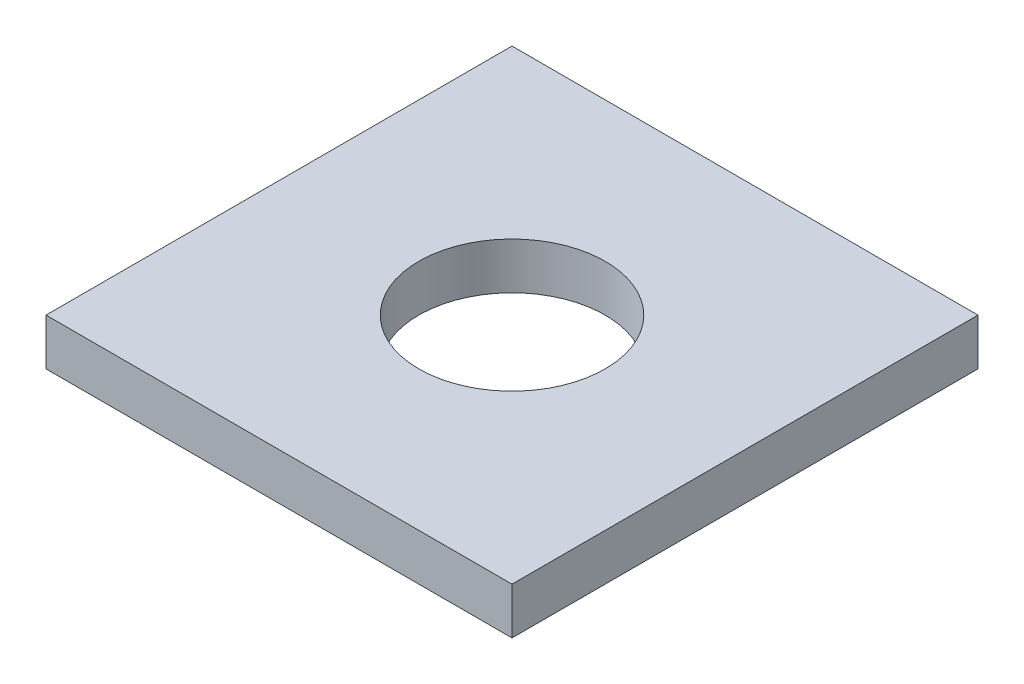
ISO-10303-21;
HEADER;
FILE_DESCRIPTION(('STEP AP214'),'2;1');
FILE_NAME('part.step','',(''),(''),'','','');
FILE_SCHEMA(('AUTOMOTIVE_DESIGN { 1 0 10303 214 1 1 1 1 }'));
ENDSEC;
DATA;
#1=APPLICATION_CONTEXT('core data for automotive mechanical design processes');
#2=APPLICATION_PROTOCOL_DEFINITION('international standard','automotive_design',2000,#1);
#3=PRODUCT_CONTEXT('',#1,'mechanical');
#4=PRODUCT('Part','Part','',(#3));
#5=PRODUCT_RELATED_PRODUCT_CATEGORY('part','',(#4));
#6=PRODUCT_DEFINITION_FORMATION('','',#4);
#7=PRODUCT_DEFINITION_CONTEXT('part definition',#1,'design');
#8=PRODUCT_DEFINITION('design','',#6,#7);
#9=PRODUCT_DEFINITION_SHAPE('','',#8);
#10=(LENGTH_UNIT() NAMED_UNIT(*) SI_UNIT(.MILLI.,.METRE.));
#11=(NAMED_UNIT(*) PLANE_ANGLE_UNIT() SI_UNIT($,.RADIAN.));
#12=(NAMED_UNIT(*) SI_UNIT($,.STERADIAN.) SOLID_ANGLE_UNIT());
#13=UNCERTAINTY_MEASURE_WITH_UNIT(LENGTH_MEASURE(1.E-05),#10,'distance_accuracy_value','');
#14=(GEOMETRIC_REPRESENTATION_CONTEXT(3) GLOBAL_UNCERTAINTY_ASSIGNED_CONTEXT((#13)) GLOBAL_UNIT_ASSIGNED_CONTEXT((#10,
#11,#12)) REPRESENTATION_CONTEXT('',''));
#15=CARTESIAN_POINT('',(0.,0.,0.));
#16=DIRECTION('',(0.,0.,1.));
#17=DIRECTION('',(1.,0.,0.));
#18=AXIS2_PLACEMENT_3D('',#15,#16,#17);
#19=CARTESIAN_POINT('',(-15.875,1.5875,15.875));
#20=DIRECTION('',(0.,-1.,0.));
#21=DIRECTION('',(0.,0.,-1.));
#22=AXIS2_PLACEMENT_3D('',#19,#20,#21);
#23=PLANE('',#22);
#24=DIRECTION('',(0.,0.,1.));
#25=VECTOR('',#24,1.);
#26=CARTESIAN_POINT('',(-15.875,1.5875,-15.875));
#27=LINE('',#26,#25);
#28=CARTESIAN_POINT('',(-15.875,1.5875,-15.875));
#29=VERTEX_POINT('',#28);
#30=CARTESIAN_POINT('',(-15.875,1.5875,15.875));
#31=VERTEX_POINT('',#30);
#32=EDGE_CURVE('E84',#29,#31,#27,.T.);
#33=ORIENTED_EDGE('',*,*,#32,.T.);
#34=DIRECTION('',(1.,0.,0.));
#35=VECTOR('',#34,1.);
#36=CARTESIAN_POINT('',(15.875,1.5875,15.875));
#37=LINE('',#36,#35);
#38=CARTESIAN_POINT('',(15.875,1.5875,15.875));
#39=VERTEX_POINT('',#38);
#40=EDGE_CURVE('E79',#31,#39,#37,.T.);
#41=ORIENTED_EDGE('',*,*,#40,.T.);
#42=DIRECTION('',(0.,0.,-1.));
#43=VECTOR('',#42,1.);
#44=CARTESIAN_POINT('',(15.875,1.5875,-15.875));
#45=LINE('',#44,#43);
#46=CARTESIAN_POINT('',(15.875,1.5875,-15.875));
#47=VERTEX_POINT('',#46);
#48=EDGE_CURVE('E82',#39,#47,#45,.T.);
#49=ORIENTED_EDGE('',*,*,#48,.T.);
#50=DIRECTION('',(-1.,0.,0.));
#51=VECTOR('',#50,1.);
#52=CARTESIAN_POINT('',(15.875,1.5875,-15.875));
#53=LINE('',#52,#51);
#54=EDGE_CURVE('E49',#47,#29,#53,.T.);
#55=ORIENTED_EDGE('',*,*,#54,.T.);
#56=EDGE_LOOP('',(#33,#41,#49,#55));
#57=FACE_BOUND('',#56,.T.);
#58=CARTESIAN_POINT('',(0.,1.5875,0.));
#59=DIRECTION('',(0.,1.,0.));
#60=DIRECTION('',(0.,0.,1.));
#61=AXIS2_PLACEMENT_3D('',#58,#59,#60);
#62=CIRCLE('',#61,6.35);
#63=CARTESIAN_POINT('',(0.,1.5875,6.35));
#64=VERTEX_POINT('',#63);
#65=EDGE_CURVE('E99',#64,#64,#62,.T.);
#66=ORIENTED_EDGE('',*,*,#65,.F.);
#67=EDGE_LOOP('',(#66));
#68=FACE_BOUND('',#67,.T.);
#69=ADVANCED_FACE('F32',(#57,#68),#23,.F.);
#70=CARTESIAN_POINT('',(-15.875,-1.5875,15.875));
#71=DIRECTION('',(0.,-1.,0.));
#72=DIRECTION('',(0.,0.,-1.));
#73=AXIS2_PLACEMENT_3D('',#70,#71,#72);
#74=PLANE('',#73);
#75=DIRECTION('',(0.,0.,1.));
#76=VECTOR('',#75,1.);
#77=CARTESIAN_POINT('',(-15.875,-1.5875,-15.875));
#78=LINE('',#77,#76);
#79=CARTESIAN_POINT('',(-15.875,-1.5875,-15.875));
#80=VERTEX_POINT('',#79);
#81=CARTESIAN_POINT('',(-15.875,-1.5875,15.875));
#82=VERTEX_POINT('',#81);
#83=EDGE_CURVE('E96',#80,#82,#78,.T.);
#84=ORIENTED_EDGE('',*,*,#83,.F.);
#85=DIRECTION('',(-1.,0.,0.));
#86=VECTOR('',#85,1.);
#87=CARTESIAN_POINT('',(15.875,-1.5875,-15.875));
#88=LINE('',#87,#86);
#89=CARTESIAN_POINT('',(15.875,-1.5875,-15.875));
#90=VERTEX_POINT('',#89);
#91=EDGE_CURVE('E72',#90,#80,#88,.T.);
#92=ORIENTED_EDGE('',*,*,#91,.F.);
#93=DIRECTION('',(0.,0.,-1.));
#94=VECTOR('',#93,1.);
#95=CARTESIAN_POINT('',(15.875,-1.5875,-15.875));
#96=LINE('',#95,#94);
#97=CARTESIAN_POINT('',(15.875,-1.5875,15.875));
#98=VERTEX_POINT('',#97);
#99=EDGE_CURVE('E66',#98,#90,#96,.T.);
#100=ORIENTED_EDGE('',*,*,#99,.F.);
#101=DIRECTION('',(1.,0.,0.));
#102=VECTOR('',#101,1.);
#103=CARTESIAN_POINT('',(15.875,-1.5875,15.875));
#104=LINE('',#103,#102);
#105=EDGE_CURVE('E88',#82,#98,#104,.T.);
#106=ORIENTED_EDGE('',*,*,#105,.F.);
#107=EDGE_LOOP('',(#84,#92,#100,#106));
#108=FACE_BOUND('',#107,.T.);
#109=CARTESIAN_POINT('',(0.,-1.5875,0.));
#110=DIRECTION('',(0.,1.,0.));
#111=DIRECTION('',(0.,0.,1.));
#112=AXIS2_PLACEMENT_3D('',#109,#110,#111);
#113=CIRCLE('',#112,6.35);
#114=CARTESIAN_POINT('',(0.,-1.5875,6.35));
#115=VERTEX_POINT('',#114);
#116=EDGE_CURVE('E111',#115,#115,#113,.T.);
#117=ORIENTED_EDGE('',*,*,#116,.T.);
#118=EDGE_LOOP('',(#117));
#119=FACE_BOUND('',#118,.T.);
#120=ADVANCED_FACE('F107',(#108,#119),#74,.T.);
#121=CARTESIAN_POINT('',(-15.875,1.5875,-15.875));
#122=DIRECTION('',(1.,0.,0.));
#123=DIRECTION('',(0.,0.,-1.));
#124=AXIS2_PLACEMENT_3D('',#121,#122,#123);
#125=PLANE('',#124);
#126=ORIENTED_EDGE('',*,*,#83,.T.);
#127=DIRECTION('',(0.,-1.,0.));
#128=VECTOR('',#127,1.);
#129=CARTESIAN_POINT('',(-15.875,1.5875,15.875));
#130=LINE('',#129,#128);
#131=EDGE_CURVE('E11',#31,#82,#130,.T.);
#132=ORIENTED_EDGE('',*,*,#131,.F.);
#133=ORIENTED_EDGE('',*,*,#32,.F.);
#134=DIRECTION('',(0.,-1.,0.));
#135=VECTOR('',#134,1.);
#136=CARTESIAN_POINT('',(-15.875,1.5875,-15.875));
#137=LINE('',#136,#135);
#138=EDGE_CURVE('E92',#29,#80,#137,.T.);
#139=ORIENTED_EDGE('',*,*,#138,.T.);
#140=EDGE_LOOP('',(#126,#132,#133,#139));
#141=FACE_BOUND('',#140,.T.);
#142=ADVANCED_FACE('F34',(#141),#125,.F.);
#143=CARTESIAN_POINT('',(15.875,1.5875,15.875));
#144=DIRECTION('',(0.,0.,-1.));
#145=DIRECTION('',(-1.,0.,0.));
#146=AXIS2_PLACEMENT_3D('',#143,#144,#145);
#147=PLANE('',#146);
#148=ORIENTED_EDGE('',*,*,#105,.T.);
#149=DIRECTION('',(0.,-1.,0.));
#150=VECTOR('',#149,1.);
#151=CARTESIAN_POINT('',(15.875,1.5875,15.875));
#152=LINE('',#151,#150);
#153=EDGE_CURVE('E41',#39,#98,#152,.T.);
#154=ORIENTED_EDGE('',*,*,#153,.F.);
#155=ORIENTED_EDGE('',*,*,#40,.F.);
#156=ORIENTED_EDGE('',*,*,#131,.T.);
#157=EDGE_LOOP('',(#148,#154,#155,#156));
#158=FACE_BOUND('',#157,.T.);
#159=ADVANCED_FACE('F87',(#158),#147,.F.);
#160=CARTESIAN_POINT('',(15.875,1.5875,-15.875));
#161=DIRECTION('',(-1.,0.,0.));
#162=DIRECTION('',(0.,0.,1.));
#163=AXIS2_PLACEMENT_3D('',#160,#161,#162);
#164=PLANE('',#163);
#165=ORIENTED_EDGE('',*,*,#99,.T.);
#166=DIRECTION('',(0.,-1.,0.));
#167=VECTOR('',#166,1.);
#168=CARTESIAN_POINT('',(15.875,1.5875,-15.875));
#169=LINE('',#168,#167);
#170=EDGE_CURVE('E89',#47,#90,#169,.T.);
#171=ORIENTED_EDGE('',*,*,#170,.F.);
#172=ORIENTED_EDGE('',*,*,#48,.F.);
#173=ORIENTED_EDGE('',*,*,#153,.T.);
#174=EDGE_LOOP('',(#165,#171,#172,#173));
#175=FACE_BOUND('',#174,.T.);
#176=ADVANCED_FACE('F90',(#175),#164,.F.);
#177=CARTESIAN_POINT('',(15.875,1.5875,-15.875));
#178=DIRECTION('',(0.,0.,1.));
#179=DIRECTION('',(1.,0.,0.));
#180=AXIS2_PLACEMENT_3D('',#177,#178,#179);
#181=PLANE('',#180);
#182=ORIENTED_EDGE('',*,*,#91,.T.);
#183=ORIENTED_EDGE('',*,*,#138,.F.);
#184=ORIENTED_EDGE('',*,*,#54,.F.);
#185=ORIENTED_EDGE('',*,*,#170,.T.);
#186=EDGE_LOOP('',(#182,#183,#184,#185));
#187=FACE_BOUND('',#186,.T.);
#188=ADVANCED_FACE('F104',(#187),#181,.F.);
#189=CARTESIAN_POINT('',(0.,1.5875,0.));
#190=DIRECTION('',(0.,-1.,0.));
#191=DIRECTION('',(0.,0.,-1.));
#192=AXIS2_PLACEMENT_3D('',#189,#190,#191);
#193=CYLINDRICAL_SURFACE('',#192,6.35);
#194=ORIENTED_EDGE('',*,*,#65,.T.);
#195=EDGE_LOOP('',(#194));
#196=FACE_BOUND('',#195,.T.);
#197=ORIENTED_EDGE('',*,*,#116,.F.);
#198=EDGE_LOOP('',(#197));
#199=FACE_BOUND('',#198,.T.);
#200=ADVANCED_FACE('F117',(#196,#199),#193,.F.);
#201=CLOSED_SHELL('',(#69,#120,#142,#159,#176,#188,#200));
#202=MANIFOLD_SOLID_BREP('B2',#201);
#203=ADVANCED_BREP_SHAPE_REPRESENTATION('',(#18,#202),#14);
#204=SHAPE_DEFINITION_REPRESENTATION(#9,#203);
ENDSEC;
END-ISO-10303-21;
